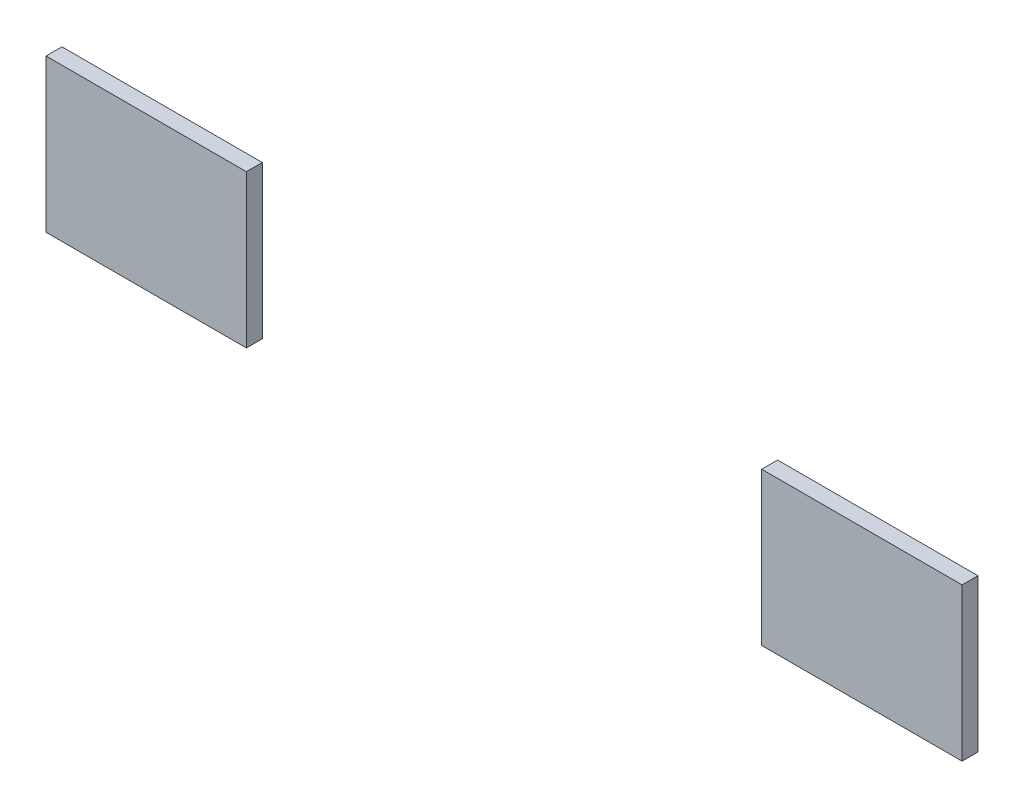
ISO-10303-21;
HEADER;
FILE_DESCRIPTION(('STEP AP214'),'2;1');
FILE_NAME('part.step','',(''),(''),'','','');
FILE_SCHEMA(('AUTOMOTIVE_DESIGN { 1 0 10303 214 1 1 1 1 }'));
ENDSEC;
DATA;
#1=APPLICATION_CONTEXT('core data for automotive mechanical design processes');
#2=APPLICATION_PROTOCOL_DEFINITION('international standard','automotive_design',2000,#1);
#3=PRODUCT_CONTEXT('',#1,'mechanical');
#4=PRODUCT('Part','Part','',(#3));
#5=PRODUCT_RELATED_PRODUCT_CATEGORY('part','',(#4));
#6=PRODUCT_DEFINITION_FORMATION('','',#4);
#7=PRODUCT_DEFINITION_CONTEXT('part definition',#1,'design');
#8=PRODUCT_DEFINITION('design','',#6,#7);
#9=PRODUCT_DEFINITION_SHAPE('','',#8);
#10=(LENGTH_UNIT() NAMED_UNIT(*) SI_UNIT(.MILLI.,.METRE.));
#11=(NAMED_UNIT(*) PLANE_ANGLE_UNIT() SI_UNIT($,.RADIAN.));
#12=(NAMED_UNIT(*) SI_UNIT($,.STERADIAN.) SOLID_ANGLE_UNIT());
#13=UNCERTAINTY_MEASURE_WITH_UNIT(LENGTH_MEASURE(1.E-05),#10,'distance_accuracy_value','');
#14=(GEOMETRIC_REPRESENTATION_CONTEXT(3) GLOBAL_UNCERTAINTY_ASSIGNED_CONTEXT((#13)) GLOBAL_UNIT_ASSIGNED_CONTEXT((#10,
#11,#12)) REPRESENTATION_CONTEXT('',''));
#15=CARTESIAN_POINT('',(0.,0.,0.));
#16=DIRECTION('',(0.,0.,1.));
#17=DIRECTION('',(1.,0.,0.));
#18=AXIS2_PLACEMENT_3D('',#15,#16,#17);
#19=CARTESIAN_POINT('',(2.88,0.481,-0.001));
#20=DIRECTION('',(1.,0.,0.));
#21=DIRECTION('',(0.,0.,1.));
#22=AXIS2_PLACEMENT_3D('',#19,#20,#21);
#23=PLANE('',#22);
#24=DIRECTION('',(0.,0.,-1.));
#25=VECTOR('',#24,1.);
#26=CARTESIAN_POINT('',(2.88,0.48,0.05));
#27=LINE('',#26,#25);
#28=CARTESIAN_POINT('',(2.88,0.48,0.1));
#29=VERTEX_POINT('',#28);
#30=CARTESIAN_POINT('',(2.88,0.48,0.));
#31=VERTEX_POINT('',#30);
#32=EDGE_CURVE('P0_E68',#29,#31,#27,.T.);
#33=ORIENTED_EDGE('',*,*,#32,.F.);
#34=DIRECTION('',(0.,1.,0.));
#35=VECTOR('',#34,1.);
#36=CARTESIAN_POINT('',(2.88,0.,0.1));
#37=LINE('',#36,#35);
#38=CARTESIAN_POINT('',(2.88,-0.48,0.1));
#39=VERTEX_POINT('',#38);
#40=EDGE_CURVE('P0_E55',#39,#29,#37,.T.);
#41=ORIENTED_EDGE('',*,*,#40,.F.);
#42=DIRECTION('',(0.,0.,1.));
#43=VECTOR('',#42,1.);
#44=CARTESIAN_POINT('',(2.88,-0.48,0.05));
#45=LINE('',#44,#43);
#46=CARTESIAN_POINT('',(2.88,-0.48,0.));
#47=VERTEX_POINT('',#46);
#48=EDGE_CURVE('P0_E20',#47,#39,#45,.T.);
#49=ORIENTED_EDGE('',*,*,#48,.F.);
#50=DIRECTION('',(0.,-1.,0.));
#51=VECTOR('',#50,1.);
#52=CARTESIAN_POINT('',(2.88,0.,0.));
#53=LINE('',#52,#51);
#54=EDGE_CURVE('P0_E80',#31,#47,#53,.T.);
#55=ORIENTED_EDGE('',*,*,#54,.F.);
#56=EDGE_LOOP('',(#33,#41,#49,#55));
#57=FACE_BOUND('',#56,.T.);
#58=ADVANCED_FACE('P0_F16',(#57),#23,.T.);
#59=CARTESIAN_POINT('',(1.619,-0.48,0.101));
#60=DIRECTION('',(0.,-1.,0.));
#61=DIRECTION('',(0.,0.,-1.));
#62=AXIS2_PLACEMENT_3D('',#59,#60,#61);
#63=PLANE('',#62);
#64=DIRECTION('',(1.,0.,0.));
#65=VECTOR('',#64,1.);
#66=CARTESIAN_POINT('',(2.25,-0.48,0.1));
#67=LINE('',#66,#65);
#68=CARTESIAN_POINT('',(1.62,-0.48,0.1));
#69=VERTEX_POINT('',#68);
#70=EDGE_CURVE('P0_E61',#69,#39,#67,.T.);
#71=ORIENTED_EDGE('',*,*,#70,.F.);
#72=DIRECTION('',(0.,0.,1.));
#73=VECTOR('',#72,1.);
#74=CARTESIAN_POINT('',(1.62,-0.48,0.05));
#75=LINE('',#74,#73);
#76=CARTESIAN_POINT('',(1.62,-0.48,0.));
#77=VERTEX_POINT('',#76);
#78=EDGE_CURVE('P0_E83',#77,#69,#75,.T.);
#79=ORIENTED_EDGE('',*,*,#78,.F.);
#80=DIRECTION('',(-1.,0.,0.));
#81=VECTOR('',#80,1.);
#82=CARTESIAN_POINT('',(2.25,-0.48,0.));
#83=LINE('',#82,#81);
#84=EDGE_CURVE('P0_E64',#47,#77,#83,.T.);
#85=ORIENTED_EDGE('',*,*,#84,.F.);
#86=ORIENTED_EDGE('',*,*,#48,.T.);
#87=EDGE_LOOP('',(#71,#79,#85,#86));
#88=FACE_BOUND('',#87,.T.);
#89=ADVANCED_FACE('P0_F60',(#88),#63,.T.);
#90=CARTESIAN_POINT('',(1.619,-0.481,0.1));
#91=DIRECTION('',(0.,0.,1.));
#92=DIRECTION('',(1.,0.,0.));
#93=AXIS2_PLACEMENT_3D('',#90,#91,#92);
#94=PLANE('',#93);
#95=ORIENTED_EDGE('',*,*,#40,.T.);
#96=DIRECTION('',(1.,0.,0.));
#97=VECTOR('',#96,1.);
#98=CARTESIAN_POINT('',(2.25,0.48,0.1));
#99=LINE('',#98,#97);
#100=CARTESIAN_POINT('',(1.62,0.48,0.1));
#101=VERTEX_POINT('',#100);
#102=EDGE_CURVE('P0_E70',#101,#29,#99,.T.);
#103=ORIENTED_EDGE('',*,*,#102,.F.);
#104=DIRECTION('',(0.,1.,0.));
#105=VECTOR('',#104,1.);
#106=CARTESIAN_POINT('',(1.62,0.,0.1));
#107=LINE('',#106,#105);
#108=EDGE_CURVE('P0_E74',#69,#101,#107,.T.);
#109=ORIENTED_EDGE('',*,*,#108,.F.);
#110=ORIENTED_EDGE('',*,*,#70,.T.);
#111=EDGE_LOOP('',(#95,#103,#109,#110));
#112=FACE_BOUND('',#111,.T.);
#113=ADVANCED_FACE('P0_F72',(#112),#94,.T.);
#114=CARTESIAN_POINT('',(1.619,0.48,-0.001));
#115=DIRECTION('',(0.,1.,0.));
#116=DIRECTION('',(0.,0.,1.));
#117=AXIS2_PLACEMENT_3D('',#114,#115,#116);
#118=PLANE('',#117);
#119=ORIENTED_EDGE('',*,*,#102,.T.);
#120=ORIENTED_EDGE('',*,*,#32,.T.);
#121=DIRECTION('',(1.,0.,0.));
#122=VECTOR('',#121,1.);
#123=CARTESIAN_POINT('',(2.25,0.48,0.));
#124=LINE('',#123,#122);
#125=CARTESIAN_POINT('',(1.62,0.48,0.));
#126=VERTEX_POINT('',#125);
#127=EDGE_CURVE('P0_E35',#126,#31,#124,.T.);
#128=ORIENTED_EDGE('',*,*,#127,.F.);
#129=DIRECTION('',(0.,0.,-1.));
#130=VECTOR('',#129,1.);
#131=CARTESIAN_POINT('',(1.62,0.48,0.05));
#132=LINE('',#131,#130);
#133=EDGE_CURVE('P0_E26',#101,#126,#132,.T.);
#134=ORIENTED_EDGE('',*,*,#133,.F.);
#135=EDGE_LOOP('',(#119,#120,#128,#134));
#136=FACE_BOUND('',#135,.T.);
#137=ADVANCED_FACE('P0_F88',(#136),#118,.T.);
#138=CARTESIAN_POINT('',(2.881,-0.481,0.));
#139=DIRECTION('',(0.,0.,-1.));
#140=DIRECTION('',(-1.,0.,0.));
#141=AXIS2_PLACEMENT_3D('',#138,#139,#140);
#142=PLANE('',#141);
#143=ORIENTED_EDGE('',*,*,#54,.T.);
#144=ORIENTED_EDGE('',*,*,#84,.T.);
#145=DIRECTION('',(0.,-1.,0.));
#146=VECTOR('',#145,1.);
#147=CARTESIAN_POINT('',(1.62,0.,0.));
#148=LINE('',#147,#146);
#149=EDGE_CURVE('P0_E11',#126,#77,#148,.T.);
#150=ORIENTED_EDGE('',*,*,#149,.F.);
#151=ORIENTED_EDGE('',*,*,#127,.T.);
#152=EDGE_LOOP('',(#143,#144,#150,#151));
#153=FACE_BOUND('',#152,.T.);
#154=ADVANCED_FACE('P0_F90',(#153),#142,.T.);
#155=CARTESIAN_POINT('',(1.62,0.481,0.101));
#156=DIRECTION('',(-1.,0.,0.));
#157=DIRECTION('',(0.,0.,-1.));
#158=AXIS2_PLACEMENT_3D('',#155,#156,#157);
#159=PLANE('',#158);
#160=ORIENTED_EDGE('',*,*,#133,.T.);
#161=ORIENTED_EDGE('',*,*,#149,.T.);
#162=ORIENTED_EDGE('',*,*,#78,.T.);
#163=ORIENTED_EDGE('',*,*,#108,.T.);
#164=EDGE_LOOP('',(#160,#161,#162,#163));
#165=FACE_BOUND('',#164,.T.);
#166=ADVANCED_FACE('P0_F18',(#165),#159,.T.);
#167=CLOSED_SHELL('',(#58,#89,#113,#137,#154,#166));
#168=MANIFOLD_SOLID_BREP('P0_B1',#167);
#169=CARTESIAN_POINT('',(-1.62,0.481,-0.001));
#170=DIRECTION('',(1.,0.,0.));
#171=DIRECTION('',(0.,0.,1.));
#172=AXIS2_PLACEMENT_3D('',#169,#170,#171);
#173=PLANE('',#172);
#174=DIRECTION('',(0.,0.,-1.));
#175=VECTOR('',#174,1.);
#176=CARTESIAN_POINT('',(-1.62,0.48,0.05));
#177=LINE('',#176,#175);
#178=CARTESIAN_POINT('',(-1.62,0.48,0.1));
#179=VERTEX_POINT('',#178);
#180=CARTESIAN_POINT('',(-1.62,0.48,0.));
#181=VERTEX_POINT('',#180);
#182=EDGE_CURVE('P1_E68',#179,#181,#177,.T.);
#183=ORIENTED_EDGE('',*,*,#182,.F.);
#184=DIRECTION('',(0.,1.,0.));
#185=VECTOR('',#184,1.);
#186=CARTESIAN_POINT('',(-1.62,0.,0.1));
#187=LINE('',#186,#185);
#188=CARTESIAN_POINT('',(-1.62,-0.48,0.1));
#189=VERTEX_POINT('',#188);
#190=EDGE_CURVE('P1_E55',#189,#179,#187,.T.);
#191=ORIENTED_EDGE('',*,*,#190,.F.);
#192=DIRECTION('',(0.,0.,1.));
#193=VECTOR('',#192,1.);
#194=CARTESIAN_POINT('',(-1.62,-0.48,0.05));
#195=LINE('',#194,#193);
#196=CARTESIAN_POINT('',(-1.62,-0.48,0.));
#197=VERTEX_POINT('',#196);
#198=EDGE_CURVE('P1_E20',#197,#189,#195,.T.);
#199=ORIENTED_EDGE('',*,*,#198,.F.);
#200=DIRECTION('',(0.,-1.,0.));
#201=VECTOR('',#200,1.);
#202=CARTESIAN_POINT('',(-1.62,0.,0.));
#203=LINE('',#202,#201);
#204=EDGE_CURVE('P1_E80',#181,#197,#203,.T.);
#205=ORIENTED_EDGE('',*,*,#204,.F.);
#206=EDGE_LOOP('',(#183,#191,#199,#205));
#207=FACE_BOUND('',#206,.T.);
#208=ADVANCED_FACE('P1_F16',(#207),#173,.T.);
#209=CARTESIAN_POINT('',(-2.881,-0.48,0.101));
#210=DIRECTION('',(0.,-1.,0.));
#211=DIRECTION('',(0.,0.,-1.));
#212=AXIS2_PLACEMENT_3D('',#209,#210,#211);
#213=PLANE('',#212);
#214=DIRECTION('',(1.,0.,0.));
#215=VECTOR('',#214,1.);
#216=CARTESIAN_POINT('',(-2.25,-0.48,0.1));
#217=LINE('',#216,#215);
#218=CARTESIAN_POINT('',(-2.88,-0.48,0.1));
#219=VERTEX_POINT('',#218);
#220=EDGE_CURVE('P1_E61',#219,#189,#217,.T.);
#221=ORIENTED_EDGE('',*,*,#220,.F.);
#222=DIRECTION('',(0.,0.,1.));
#223=VECTOR('',#222,1.);
#224=CARTESIAN_POINT('',(-2.88,-0.48,0.05));
#225=LINE('',#224,#223);
#226=CARTESIAN_POINT('',(-2.88,-0.48,0.));
#227=VERTEX_POINT('',#226);
#228=EDGE_CURVE('P1_E83',#227,#219,#225,.T.);
#229=ORIENTED_EDGE('',*,*,#228,.F.);
#230=DIRECTION('',(-1.,0.,0.));
#231=VECTOR('',#230,1.);
#232=CARTESIAN_POINT('',(-2.25,-0.48,0.));
#233=LINE('',#232,#231);
#234=EDGE_CURVE('P1_E64',#197,#227,#233,.T.);
#235=ORIENTED_EDGE('',*,*,#234,.F.);
#236=ORIENTED_EDGE('',*,*,#198,.T.);
#237=EDGE_LOOP('',(#221,#229,#235,#236));
#238=FACE_BOUND('',#237,.T.);
#239=ADVANCED_FACE('P1_F60',(#238),#213,.T.);
#240=CARTESIAN_POINT('',(-2.881,-0.481,0.1));
#241=DIRECTION('',(0.,0.,1.));
#242=DIRECTION('',(1.,0.,0.));
#243=AXIS2_PLACEMENT_3D('',#240,#241,#242);
#244=PLANE('',#243);
#245=ORIENTED_EDGE('',*,*,#190,.T.);
#246=DIRECTION('',(1.,0.,0.));
#247=VECTOR('',#246,1.);
#248=CARTESIAN_POINT('',(-2.25,0.48,0.1));
#249=LINE('',#248,#247);
#250=CARTESIAN_POINT('',(-2.88,0.48,0.1));
#251=VERTEX_POINT('',#250);
#252=EDGE_CURVE('P1_E70',#251,#179,#249,.T.);
#253=ORIENTED_EDGE('',*,*,#252,.F.);
#254=DIRECTION('',(0.,1.,0.));
#255=VECTOR('',#254,1.);
#256=CARTESIAN_POINT('',(-2.88,0.,0.1));
#257=LINE('',#256,#255);
#258=EDGE_CURVE('P1_E74',#219,#251,#257,.T.);
#259=ORIENTED_EDGE('',*,*,#258,.F.);
#260=ORIENTED_EDGE('',*,*,#220,.T.);
#261=EDGE_LOOP('',(#245,#253,#259,#260));
#262=FACE_BOUND('',#261,.T.);
#263=ADVANCED_FACE('P1_F72',(#262),#244,.T.);
#264=CARTESIAN_POINT('',(-2.881,0.48,-0.001));
#265=DIRECTION('',(0.,1.,0.));
#266=DIRECTION('',(0.,0.,1.));
#267=AXIS2_PLACEMENT_3D('',#264,#265,#266);
#268=PLANE('',#267);
#269=ORIENTED_EDGE('',*,*,#252,.T.);
#270=ORIENTED_EDGE('',*,*,#182,.T.);
#271=DIRECTION('',(1.,0.,0.));
#272=VECTOR('',#271,1.);
#273=CARTESIAN_POINT('',(-2.25,0.48,0.));
#274=LINE('',#273,#272);
#275=CARTESIAN_POINT('',(-2.88,0.48,0.));
#276=VERTEX_POINT('',#275);
#277=EDGE_CURVE('P1_E35',#276,#181,#274,.T.);
#278=ORIENTED_EDGE('',*,*,#277,.F.);
#279=DIRECTION('',(0.,0.,-1.));
#280=VECTOR('',#279,1.);
#281=CARTESIAN_POINT('',(-2.88,0.48,0.05));
#282=LINE('',#281,#280);
#283=EDGE_CURVE('P1_E26',#251,#276,#282,.T.);
#284=ORIENTED_EDGE('',*,*,#283,.F.);
#285=EDGE_LOOP('',(#269,#270,#278,#284));
#286=FACE_BOUND('',#285,.T.);
#287=ADVANCED_FACE('P1_F88',(#286),#268,.T.);
#288=CARTESIAN_POINT('',(-1.619,-0.481,0.));
#289=DIRECTION('',(0.,0.,-1.));
#290=DIRECTION('',(-1.,0.,0.));
#291=AXIS2_PLACEMENT_3D('',#288,#289,#290);
#292=PLANE('',#291);
#293=ORIENTED_EDGE('',*,*,#204,.T.);
#294=ORIENTED_EDGE('',*,*,#234,.T.);
#295=DIRECTION('',(0.,-1.,0.));
#296=VECTOR('',#295,1.);
#297=CARTESIAN_POINT('',(-2.88,0.,0.));
#298=LINE('',#297,#296);
#299=EDGE_CURVE('P1_E11',#276,#227,#298,.T.);
#300=ORIENTED_EDGE('',*,*,#299,.F.);
#301=ORIENTED_EDGE('',*,*,#277,.T.);
#302=EDGE_LOOP('',(#293,#294,#300,#301));
#303=FACE_BOUND('',#302,.T.);
#304=ADVANCED_FACE('P1_F90',(#303),#292,.T.);
#305=CARTESIAN_POINT('',(-2.88,0.481,0.101));
#306=DIRECTION('',(-1.,0.,0.));
#307=DIRECTION('',(0.,0.,-1.));
#308=AXIS2_PLACEMENT_3D('',#305,#306,#307);
#309=PLANE('',#308);
#310=ORIENTED_EDGE('',*,*,#283,.T.);
#311=ORIENTED_EDGE('',*,*,#299,.T.);
#312=ORIENTED_EDGE('',*,*,#228,.T.);
#313=ORIENTED_EDGE('',*,*,#258,.T.);
#314=EDGE_LOOP('',(#310,#311,#312,#313));
#315=FACE_BOUND('',#314,.T.);
#316=ADVANCED_FACE('P1_F18',(#315),#309,.T.);
#317=CLOSED_SHELL('',(#208,#239,#263,#287,#304,#316));
#318=MANIFOLD_SOLID_BREP('P1_B1',#317);
#319=ADVANCED_BREP_SHAPE_REPRESENTATION('',(#18,#168,#318),#14);
#320=SHAPE_DEFINITION_REPRESENTATION(#9,#319);
ENDSEC;
END-ISO-10303-21;
